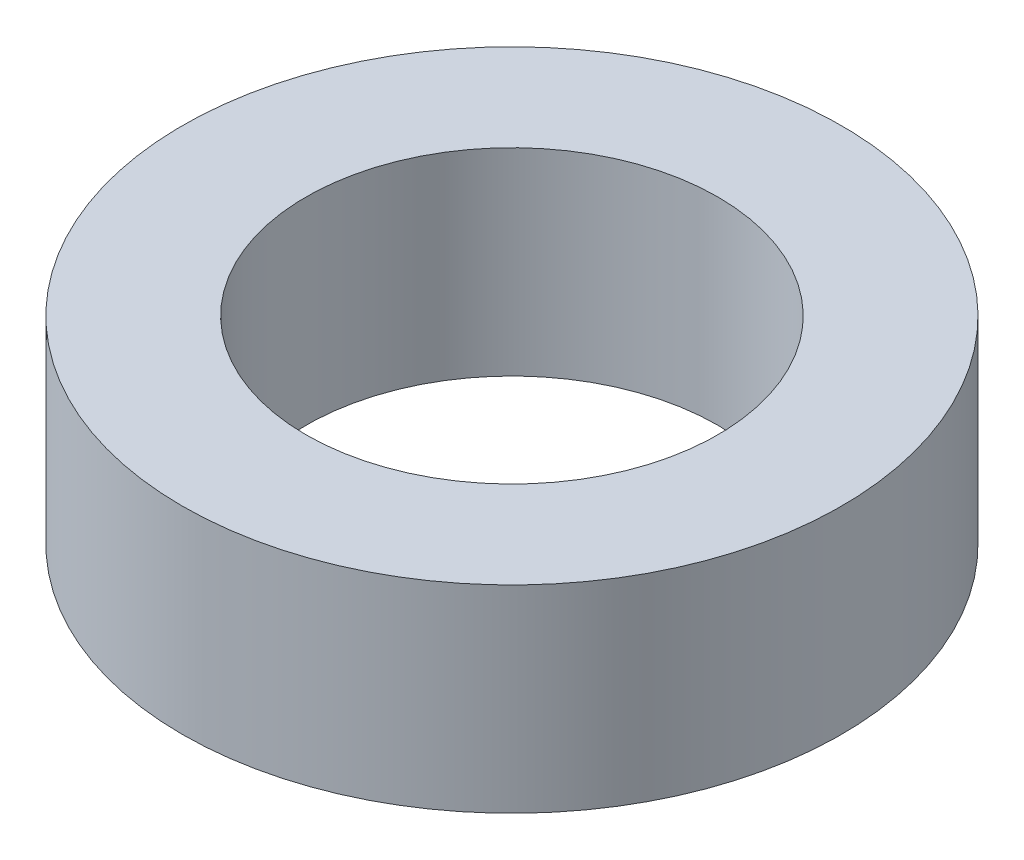
ISO-10303-21;
HEADER;
FILE_DESCRIPTION(('STEP AP214'),'2;1');
FILE_NAME('part.step','',(''),(''),'','','');
FILE_SCHEMA(('AUTOMOTIVE_DESIGN { 1 0 10303 214 1 1 1 1 }'));
ENDSEC;
DATA;
#1=APPLICATION_CONTEXT('core data for automotive mechanical design processes');
#2=APPLICATION_PROTOCOL_DEFINITION('international standard','automotive_design',2000,#1);
#3=PRODUCT_CONTEXT('',#1,'mechanical');
#4=PRODUCT('Part','Part','',(#3));
#5=PRODUCT_RELATED_PRODUCT_CATEGORY('part','',(#4));
#6=PRODUCT_DEFINITION_FORMATION('','',#4);
#7=PRODUCT_DEFINITION_CONTEXT('part definition',#1,'design');
#8=PRODUCT_DEFINITION('design','',#6,#7);
#9=PRODUCT_DEFINITION_SHAPE('','',#8);
#10=(LENGTH_UNIT() NAMED_UNIT(*) SI_UNIT(.MILLI.,.METRE.));
#11=(NAMED_UNIT(*) PLANE_ANGLE_UNIT() SI_UNIT($,.RADIAN.));
#12=(NAMED_UNIT(*) SI_UNIT($,.STERADIAN.) SOLID_ANGLE_UNIT());
#13=UNCERTAINTY_MEASURE_WITH_UNIT(LENGTH_MEASURE(1.E-05),#10,'distance_accuracy_value','');
#14=(GEOMETRIC_REPRESENTATION_CONTEXT(3) GLOBAL_UNCERTAINTY_ASSIGNED_CONTEXT((#13)) GLOBAL_UNIT_ASSIGNED_CONTEXT((#10,
#11,#12)) REPRESENTATION_CONTEXT('',''));
#15=CARTESIAN_POINT('',(0.,0.,0.));
#16=DIRECTION('',(0.,0.,1.));
#17=DIRECTION('',(1.,0.,0.));
#18=AXIS2_PLACEMENT_3D('',#15,#16,#17);
#19=CARTESIAN_POINT('',(0.,12.,0.));
#20=DIRECTION('',(0.,-1.,0.));
#21=DIRECTION('',(0.,0.,-1.));
#22=AXIS2_PLACEMENT_3D('',#19,#20,#21);
#23=CYLINDRICAL_SURFACE('',#22,20.);
#24=CARTESIAN_POINT('',(0.,12.,0.));
#25=DIRECTION('',(0.,1.,0.));
#26=DIRECTION('',(0.,0.,1.));
#27=AXIS2_PLACEMENT_3D('',#24,#25,#26);
#28=CIRCLE('',#27,20.);
#29=CARTESIAN_POINT('',(0.,12.,20.));
#30=VERTEX_POINT('',#29);
#31=EDGE_CURVE('E10',#30,#30,#28,.T.);
#32=ORIENTED_EDGE('',*,*,#31,.F.);
#33=EDGE_LOOP('',(#32));
#34=FACE_BOUND('',#33,.T.);
#35=CARTESIAN_POINT('',(0.,0.,0.));
#36=DIRECTION('',(0.,1.,0.));
#37=DIRECTION('',(0.,0.,1.));
#38=AXIS2_PLACEMENT_3D('',#35,#36,#37);
#39=CIRCLE('',#38,20.);
#40=CARTESIAN_POINT('',(0.,0.,20.));
#41=VERTEX_POINT('',#40);
#42=EDGE_CURVE('E37',#41,#41,#39,.T.);
#43=ORIENTED_EDGE('',*,*,#42,.T.);
#44=EDGE_LOOP('',(#43));
#45=FACE_BOUND('',#44,.T.);
#46=ADVANCED_FACE('F40',(#34,#45),#23,.T.);
#47=CARTESIAN_POINT('',(0.,12.,0.));
#48=DIRECTION('',(0.,1.,0.));
#49=DIRECTION('',(0.,0.,1.));
#50=AXIS2_PLACEMENT_3D('',#47,#48,#49);
#51=PLANE('',#50);
#52=CARTESIAN_POINT('',(0.,12.,0.));
#53=DIRECTION('',(0.,1.,0.));
#54=DIRECTION('',(0.,0.,1.));
#55=AXIS2_PLACEMENT_3D('',#52,#53,#54);
#56=CIRCLE('',#55,12.5);
#57=CARTESIAN_POINT('',(0.,12.,12.5));
#58=VERTEX_POINT('',#57);
#59=EDGE_CURVE('E50',#58,#58,#56,.T.);
#60=ORIENTED_EDGE('',*,*,#59,.F.);
#61=EDGE_LOOP('',(#60));
#62=FACE_BOUND('',#61,.T.);
#63=ORIENTED_EDGE('',*,*,#31,.T.);
#64=EDGE_LOOP('',(#63));
#65=FACE_BOUND('',#64,.T.);
#66=ADVANCED_FACE('F59',(#62,#65),#51,.T.);
#67=CARTESIAN_POINT('',(0.,0.,0.));
#68=DIRECTION('',(0.,1.,0.));
#69=DIRECTION('',(0.,0.,1.));
#70=AXIS2_PLACEMENT_3D('',#67,#68,#69);
#71=PLANE('',#70);
#72=CARTESIAN_POINT('',(0.,0.,0.));
#73=DIRECTION('',(0.,1.,0.));
#74=DIRECTION('',(0.,0.,1.));
#75=AXIS2_PLACEMENT_3D('',#72,#73,#74);
#76=CIRCLE('',#75,12.5);
#77=CARTESIAN_POINT('',(0.,0.,12.5));
#78=VERTEX_POINT('',#77);
#79=EDGE_CURVE('E47',#78,#78,#76,.T.);
#80=ORIENTED_EDGE('',*,*,#79,.T.);
#81=EDGE_LOOP('',(#80));
#82=FACE_BOUND('',#81,.T.);
#83=ORIENTED_EDGE('',*,*,#42,.F.);
#84=EDGE_LOOP('',(#83));
#85=FACE_BOUND('',#84,.T.);
#86=ADVANCED_FACE('F58',(#82,#85),#71,.F.);
#87=CARTESIAN_POINT('',(0.,12.,0.));
#88=DIRECTION('',(0.,-1.,0.));
#89=DIRECTION('',(0.,0.,-1.));
#90=AXIS2_PLACEMENT_3D('',#87,#88,#89);
#91=CYLINDRICAL_SURFACE('',#90,12.5);
#92=ORIENTED_EDGE('',*,*,#59,.T.);
#93=EDGE_LOOP('',(#92));
#94=FACE_BOUND('',#93,.T.);
#95=ORIENTED_EDGE('',*,*,#79,.F.);
#96=EDGE_LOOP('',(#95));
#97=FACE_BOUND('',#96,.T.);
#98=ADVANCED_FACE('F54',(#94,#97),#91,.F.);
#99=CLOSED_SHELL('',(#46,#66,#86,#98));
#100=MANIFOLD_SOLID_BREP('B2',#99);
#101=ADVANCED_BREP_SHAPE_REPRESENTATION('',(#18,#100),#14);
#102=SHAPE_DEFINITION_REPRESENTATION(#9,#101);
ENDSEC;
END-ISO-10303-21;
